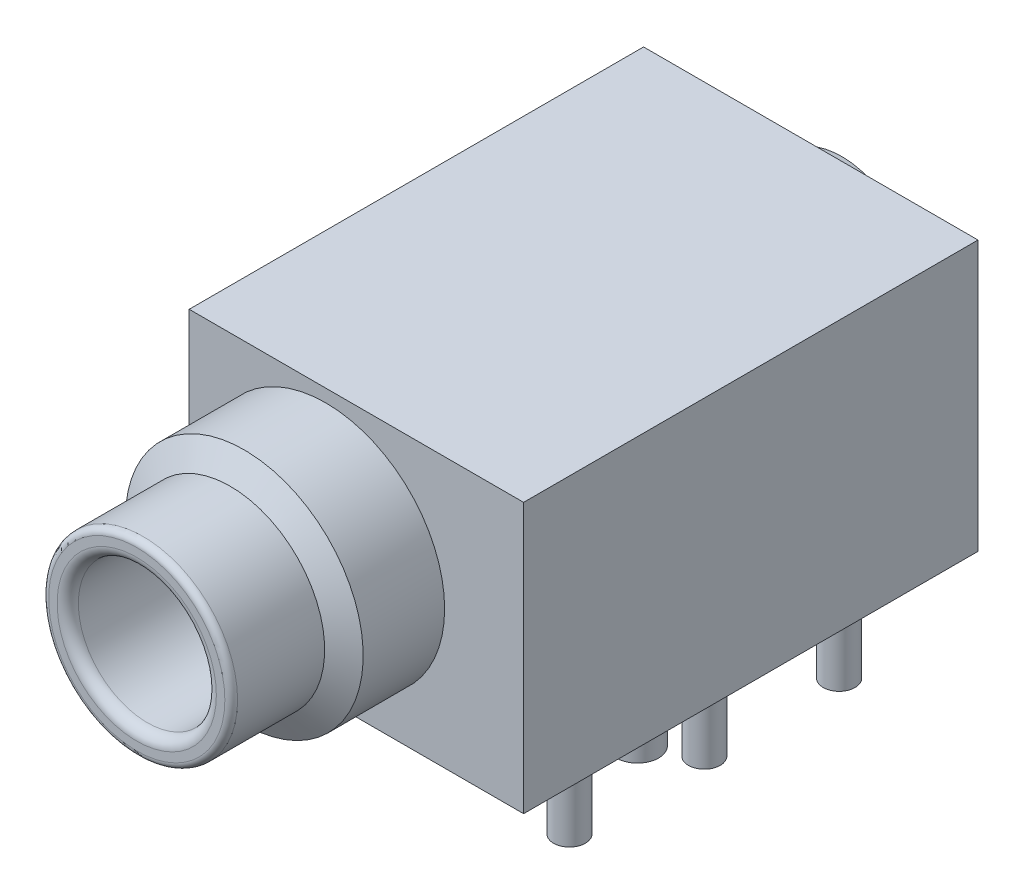
ISO-10303-21;
HEADER;
FILE_DESCRIPTION(('STEP AP214'),'2;1');
FILE_NAME('part.step','',(''),(''),'','','');
FILE_SCHEMA(('AUTOMOTIVE_DESIGN { 1 0 10303 214 1 1 1 1 }'));
ENDSEC;
DATA;
#1=APPLICATION_CONTEXT('core data for automotive mechanical design processes');
#2=APPLICATION_PROTOCOL_DEFINITION('international standard','automotive_design',2000,#1);
#3=PRODUCT_CONTEXT('',#1,'mechanical');
#4=PRODUCT('Part','Part','',(#3));
#5=PRODUCT_RELATED_PRODUCT_CATEGORY('part','',(#4));
#6=PRODUCT_DEFINITION_FORMATION('','',#4);
#7=PRODUCT_DEFINITION_CONTEXT('part definition',#1,'design');
#8=PRODUCT_DEFINITION('design','',#6,#7);
#9=PRODUCT_DEFINITION_SHAPE('','',#8);
#10=(LENGTH_UNIT() NAMED_UNIT(*) SI_UNIT(.MILLI.,.METRE.));
#11=(NAMED_UNIT(*) PLANE_ANGLE_UNIT() SI_UNIT($,.RADIAN.));
#12=(NAMED_UNIT(*) SI_UNIT($,.STERADIAN.) SOLID_ANGLE_UNIT());
#13=UNCERTAINTY_MEASURE_WITH_UNIT(LENGTH_MEASURE(1.E-05),#10,'distance_accuracy_value','');
#14=(GEOMETRIC_REPRESENTATION_CONTEXT(3) GLOBAL_UNCERTAINTY_ASSIGNED_CONTEXT((#13)) GLOBAL_UNIT_ASSIGNED_CONTEXT((#10,
#11,#12)) REPRESENTATION_CONTEXT('',''));
#15=CARTESIAN_POINT('',(0.,0.,0.));
#16=DIRECTION('',(0.,0.,1.));
#17=DIRECTION('',(1.,0.,0.));
#18=AXIS2_PLACEMENT_3D('',#15,#16,#17);
#19=CARTESIAN_POINT('',(-6.43,12.7,-21.4));
#20=DIRECTION('',(0.,0.,-1.));
#21=DIRECTION('',(-1.,0.,0.));
#22=AXIS2_PLACEMENT_3D('',#19,#20,#21);
#23=PLANE('',#22);
#24=CARTESIAN_POINT('',(0.,6.5,-21.4));
#25=DIRECTION('',(0.,0.,-1.));
#26=DIRECTION('',(-1.,0.,0.));
#27=AXIS2_PLACEMENT_3D('',#24,#25,#26);
#28=CIRCLE('',#27,4.15000000002129);
#29=CARTESIAN_POINT('',(-4.15000000002129,6.5,-21.4));
#30=VERTEX_POINT('',#29);
#31=EDGE_CURVE('E152',#30,#30,#28,.T.);
#32=ORIENTED_EDGE('',*,*,#31,.F.);
#33=EDGE_LOOP('',(#32));
#34=FACE_BOUND('',#33,.T.);
#35=DIRECTION('',(1.,0.,0.));
#36=VECTOR('',#35,1.);
#37=CARTESIAN_POINT('',(-6.43,0.,-21.4));
#38=LINE('',#37,#36);
#39=CARTESIAN_POINT('',(-6.43,0.,-21.4));
#40=VERTEX_POINT('',#39);
#41=CARTESIAN_POINT('',(9.32,0.,-21.4));
#42=VERTEX_POINT('',#41);
#43=EDGE_CURVE('E132',#40,#42,#38,.T.);
#44=ORIENTED_EDGE('',*,*,#43,.F.);
#45=DIRECTION('',(0.,-1.,0.));
#46=VECTOR('',#45,1.);
#47=CARTESIAN_POINT('',(-6.43,12.7,-21.4));
#48=LINE('',#47,#46);
#49=CARTESIAN_POINT('',(-6.43,12.7,-21.4));
#50=VERTEX_POINT('',#49);
#51=EDGE_CURVE('E49',#50,#40,#48,.T.);
#52=ORIENTED_EDGE('',*,*,#51,.F.);
#53=DIRECTION('',(1.,0.,0.));
#54=VECTOR('',#53,1.);
#55=CARTESIAN_POINT('',(-6.43,12.7,-21.4));
#56=LINE('',#55,#54);
#57=CARTESIAN_POINT('',(9.32,12.7,-21.4));
#58=VERTEX_POINT('',#57);
#59=EDGE_CURVE('E133',#50,#58,#56,.T.);
#60=ORIENTED_EDGE('',*,*,#59,.T.);
#61=DIRECTION('',(0.,-1.,0.));
#62=VECTOR('',#61,1.);
#63=CARTESIAN_POINT('',(9.32,12.7,-21.4));
#64=LINE('',#63,#62);
#65=EDGE_CURVE('E78',#58,#42,#64,.T.);
#66=ORIENTED_EDGE('',*,*,#65,.T.);
#67=EDGE_LOOP('',(#44,#52,#60,#66));
#68=FACE_BOUND('',#67,.T.);
#69=ADVANCED_FACE('F32',(#34,#68),#23,.T.);
#70=CARTESIAN_POINT('',(-6.43,12.7,0.));
#71=DIRECTION('',(-1.,0.,0.));
#72=DIRECTION('',(0.,0.,1.));
#73=AXIS2_PLACEMENT_3D('',#70,#71,#72);
#74=PLANE('',#73);
#75=DIRECTION('',(0.,0.,-1.));
#76=VECTOR('',#75,1.);
#77=CARTESIAN_POINT('',(-6.43,0.,0.));
#78=LINE('',#77,#76);
#79=CARTESIAN_POINT('',(-6.43,0.,0.));
#80=VERTEX_POINT('',#79);
#81=EDGE_CURVE('E136',#80,#40,#78,.T.);
#82=ORIENTED_EDGE('',*,*,#81,.F.);
#83=DIRECTION('',(0.,-1.,0.));
#84=VECTOR('',#83,1.);
#85=CARTESIAN_POINT('',(-6.43,12.7,0.));
#86=LINE('',#85,#84);
#87=CARTESIAN_POINT('',(-6.43,12.7,0.));
#88=VERTEX_POINT('',#87);
#89=EDGE_CURVE('E67',#88,#80,#86,.T.);
#90=ORIENTED_EDGE('',*,*,#89,.F.);
#91=DIRECTION('',(0.,0.,-1.));
#92=VECTOR('',#91,1.);
#93=CARTESIAN_POINT('',(-6.43,12.7,0.));
#94=LINE('',#93,#92);
#95=EDGE_CURVE('E140',#88,#50,#94,.T.);
#96=ORIENTED_EDGE('',*,*,#95,.T.);
#97=ORIENTED_EDGE('',*,*,#51,.T.);
#98=EDGE_LOOP('',(#82,#90,#96,#97));
#99=FACE_BOUND('',#98,.T.);
#100=ADVANCED_FACE('F207',(#99),#74,.T.);
#101=CARTESIAN_POINT('',(9.32,12.7,0.));
#102=DIRECTION('',(0.,0.,1.));
#103=DIRECTION('',(1.,0.,0.));
#104=AXIS2_PLACEMENT_3D('',#101,#102,#103);
#105=PLANE('',#104);
#106=CARTESIAN_POINT('',(0.,6.5,0.));
#107=DIRECTION('',(0.,0.,1.));
#108=DIRECTION('',(1.,0.,0.));
#109=AXIS2_PLACEMENT_3D('',#106,#107,#108);
#110=CIRCLE('',#109,5.60000000000746);
#111=CARTESIAN_POINT('',(5.60000000000746,6.5,0.));
#112=VERTEX_POINT('',#111);
#113=EDGE_CURVE('E186',#112,#112,#110,.T.);
#114=ORIENTED_EDGE('',*,*,#113,.F.);
#115=EDGE_LOOP('',(#114));
#116=FACE_BOUND('',#115,.T.);
#117=DIRECTION('',(-1.,0.,0.));
#118=VECTOR('',#117,1.);
#119=CARTESIAN_POINT('',(9.32,0.,0.));
#120=LINE('',#119,#118);
#121=CARTESIAN_POINT('',(9.32,0.,0.));
#122=VERTEX_POINT('',#121);
#123=EDGE_CURVE('E147',#122,#80,#120,.T.);
#124=ORIENTED_EDGE('',*,*,#123,.F.);
#125=DIRECTION('',(0.,-1.,0.));
#126=VECTOR('',#125,1.);
#127=CARTESIAN_POINT('',(9.32,12.7,0.));
#128=LINE('',#127,#126);
#129=CARTESIAN_POINT('',(9.32,12.7,0.));
#130=VERTEX_POINT('',#129);
#131=EDGE_CURVE('E154',#130,#122,#128,.T.);
#132=ORIENTED_EDGE('',*,*,#131,.F.);
#133=DIRECTION('',(-1.,0.,0.));
#134=VECTOR('',#133,1.);
#135=CARTESIAN_POINT('',(9.32,12.7,0.));
#136=LINE('',#135,#134);
#137=EDGE_CURVE('E138',#130,#88,#136,.T.);
#138=ORIENTED_EDGE('',*,*,#137,.T.);
#139=ORIENTED_EDGE('',*,*,#89,.T.);
#140=EDGE_LOOP('',(#124,#132,#138,#139));
#141=FACE_BOUND('',#140,.T.);
#142=ADVANCED_FACE('F213',(#116,#141),#105,.T.);
#143=CARTESIAN_POINT('',(9.32,12.7,-21.4));
#144=DIRECTION('',(1.,0.,0.));
#145=DIRECTION('',(0.,0.,-1.));
#146=AXIS2_PLACEMENT_3D('',#143,#144,#145);
#147=PLANE('',#146);
#148=DIRECTION('',(0.,0.,1.));
#149=VECTOR('',#148,1.);
#150=CARTESIAN_POINT('',(9.32,0.,-21.4));
#151=LINE('',#150,#149);
#152=EDGE_CURVE('E144',#42,#122,#151,.T.);
#153=ORIENTED_EDGE('',*,*,#152,.F.);
#154=ORIENTED_EDGE('',*,*,#65,.F.);
#155=DIRECTION('',(0.,0.,1.));
#156=VECTOR('',#155,1.);
#157=CARTESIAN_POINT('',(9.32,12.7,-21.4));
#158=LINE('',#157,#156);
#159=EDGE_CURVE('E135',#58,#130,#158,.T.);
#160=ORIENTED_EDGE('',*,*,#159,.T.);
#161=ORIENTED_EDGE('',*,*,#131,.T.);
#162=EDGE_LOOP('',(#153,#154,#160,#161));
#163=FACE_BOUND('',#162,.T.);
#164=ADVANCED_FACE('F217',(#163),#147,.T.);
#165=CARTESIAN_POINT('',(0.,12.7,0.));
#166=DIRECTION('',(0.,-1.,0.));
#167=DIRECTION('',(0.,0.,-1.));
#168=AXIS2_PLACEMENT_3D('',#165,#166,#167);
#169=PLANE('',#168);
#170=ORIENTED_EDGE('',*,*,#59,.F.);
#171=ORIENTED_EDGE('',*,*,#95,.F.);
#172=ORIENTED_EDGE('',*,*,#137,.F.);
#173=ORIENTED_EDGE('',*,*,#159,.F.);
#174=EDGE_LOOP('',(#170,#171,#172,#173));
#175=FACE_BOUND('',#174,.T.);
#176=ADVANCED_FACE('F220',(#175),#169,.F.);
#177=CARTESIAN_POINT('',(0.,0.,0.));
#178=DIRECTION('',(0.,-1.,0.));
#179=DIRECTION('',(0.,0.,-1.));
#180=AXIS2_PLACEMENT_3D('',#177,#178,#179);
#181=PLANE('',#180);
#182=CARTESIAN_POINT('',(-4.2,0.,-7.45));
#183=DIRECTION('',(0.,-1.,0.));
#184=DIRECTION('',(0.,0.,-1.));
#185=AXIS2_PLACEMENT_3D('',#182,#183,#184);
#186=CIRCLE('',#185,1.);
#187=CARTESIAN_POINT('',(-4.2,0.,-8.45));
#188=VERTEX_POINT('',#187);
#189=EDGE_CURVE('E183',#188,#188,#186,.T.);
#190=ORIENTED_EDGE('',*,*,#189,.F.);
#191=EDGE_LOOP('',(#190));
#192=FACE_BOUND('',#191,.T.);
#193=CARTESIAN_POINT('',(7.23,0.,-7.45));
#194=DIRECTION('',(0.,-1.,0.));
#195=DIRECTION('',(0.,0.,-1.));
#196=AXIS2_PLACEMENT_3D('',#193,#194,#195);
#197=CIRCLE('',#196,1.);
#198=CARTESIAN_POINT('',(7.23,0.,-8.45));
#199=VERTEX_POINT('',#198);
#200=EDGE_CURVE('E180',#199,#199,#197,.T.);
#201=ORIENTED_EDGE('',*,*,#200,.F.);
#202=EDGE_LOOP('',(#201));
#203=FACE_BOUND('',#202,.T.);
#204=CARTESIAN_POINT('',(5.1,0.,-13.8));
#205=DIRECTION('',(0.,-1.,0.));
#206=DIRECTION('',(0.,0.,-1.));
#207=AXIS2_PLACEMENT_3D('',#204,#205,#206);
#208=CIRCLE('',#207,1.5);
#209=CARTESIAN_POINT('',(5.1,0.,-15.3));
#210=VERTEX_POINT('',#209);
#211=EDGE_CURVE('E177',#210,#210,#208,.T.);
#212=ORIENTED_EDGE('',*,*,#211,.F.);
#213=EDGE_LOOP('',(#212));
#214=FACE_BOUND('',#213,.T.);
#215=CARTESIAN_POINT('',(7.23,0.,-4.25));
#216=DIRECTION('',(0.,-1.,0.));
#217=DIRECTION('',(0.,0.,-1.));
#218=AXIS2_PLACEMENT_3D('',#215,#216,#217);
#219=CIRCLE('',#218,0.750000000000001);
#220=CARTESIAN_POINT('',(7.23,0.,-5.));
#221=VERTEX_POINT('',#220);
#222=EDGE_CURVE('E174',#221,#221,#219,.T.);
#223=ORIENTED_EDGE('',*,*,#222,.F.);
#224=EDGE_LOOP('',(#223));
#225=FACE_BOUND('',#224,.T.);
#226=CARTESIAN_POINT('',(7.23,0.,-16.95));
#227=DIRECTION('',(0.,-1.,0.));
#228=DIRECTION('',(0.,0.,-1.));
#229=AXIS2_PLACEMENT_3D('',#226,#227,#228);
#230=CIRCLE('',#229,0.750000000000001);
#231=CARTESIAN_POINT('',(7.23,0.,-17.7));
#232=VERTEX_POINT('',#231);
#233=EDGE_CURVE('E171',#232,#232,#230,.T.);
#234=ORIENTED_EDGE('',*,*,#233,.F.);
#235=EDGE_LOOP('',(#234));
#236=FACE_BOUND('',#235,.T.);
#237=CARTESIAN_POINT('',(-4.2,0.,-4.25));
#238=DIRECTION('',(0.,-1.,0.));
#239=DIRECTION('',(0.,0.,-1.));
#240=AXIS2_PLACEMENT_3D('',#237,#238,#239);
#241=CIRCLE('',#240,0.75);
#242=CARTESIAN_POINT('',(-4.2,0.,-5.));
#243=VERTEX_POINT('',#242);
#244=EDGE_CURVE('E168',#243,#243,#241,.T.);
#245=ORIENTED_EDGE('',*,*,#244,.F.);
#246=EDGE_LOOP('',(#245));
#247=FACE_BOUND('',#246,.T.);
#248=CARTESIAN_POINT('',(-4.2,0.,-16.95));
#249=DIRECTION('',(0.,-1.,0.));
#250=DIRECTION('',(0.,0.,-1.));
#251=AXIS2_PLACEMENT_3D('',#248,#249,#250);
#252=CIRCLE('',#251,0.75);
#253=CARTESIAN_POINT('',(-4.2,0.,-17.7));
#254=VERTEX_POINT('',#253);
#255=EDGE_CURVE('E165',#254,#254,#252,.T.);
#256=ORIENTED_EDGE('',*,*,#255,.F.);
#257=EDGE_LOOP('',(#256));
#258=FACE_BOUND('',#257,.T.);
#259=CARTESIAN_POINT('',(7.23,0.,-10.6));
#260=DIRECTION('',(0.,-1.,0.));
#261=DIRECTION('',(0.,0.,-1.));
#262=AXIS2_PLACEMENT_3D('',#259,#260,#261);
#263=CIRCLE('',#262,0.750000000000001);
#264=CARTESIAN_POINT('',(7.23,0.,-11.35));
#265=VERTEX_POINT('',#264);
#266=EDGE_CURVE('E162',#265,#265,#263,.T.);
#267=ORIENTED_EDGE('',*,*,#266,.F.);
#268=EDGE_LOOP('',(#267));
#269=FACE_BOUND('',#268,.T.);
#270=CARTESIAN_POINT('',(-4.2,0.,-10.6));
#271=DIRECTION('',(0.,-1.,0.));
#272=DIRECTION('',(0.,0.,-1.));
#273=AXIS2_PLACEMENT_3D('',#270,#271,#272);
#274=CIRCLE('',#273,0.75);
#275=CARTESIAN_POINT('',(-4.2,0.,-11.35));
#276=VERTEX_POINT('',#275);
#277=EDGE_CURVE('E159',#276,#276,#274,.T.);
#278=ORIENTED_EDGE('',*,*,#277,.F.);
#279=EDGE_LOOP('',(#278));
#280=FACE_BOUND('',#279,.T.);
#281=ORIENTED_EDGE('',*,*,#43,.T.);
#282=ORIENTED_EDGE('',*,*,#152,.T.);
#283=ORIENTED_EDGE('',*,*,#123,.T.);
#284=ORIENTED_EDGE('',*,*,#81,.T.);
#285=EDGE_LOOP('',(#281,#282,#283,#284));
#286=FACE_BOUND('',#285,.T.);
#287=ADVANCED_FACE('F224',(#192,#203,#214,#225,#236,#247,#258,#269,#280,#286),#181,.T.);
#288=CARTESIAN_POINT('',(0.,6.5,-24.3));
#289=DIRECTION('',(0.,0.,1.));
#290=DIRECTION('',(1.,0.,0.));
#291=AXIS2_PLACEMENT_3D('',#288,#289,#290);
#292=CONICAL_SURFACE('',#291,3.50000000001933,0.220493761367315);
#293=ORIENTED_EDGE('',*,*,#31,.T.);
#294=EDGE_LOOP('',(#293));
#295=FACE_BOUND('',#294,.T.);
#296=CARTESIAN_POINT('',(0.,6.5,-24.3));
#297=DIRECTION('',(0.,0.,-1.));
#298=DIRECTION('',(-1.,0.,0.));
#299=AXIS2_PLACEMENT_3D('',#296,#297,#298);
#300=CIRCLE('',#299,3.50000000001933);
#301=CARTESIAN_POINT('',(-3.50000000001933,6.5,-24.3));
#302=VERTEX_POINT('',#301);
#303=EDGE_CURVE('E129',#302,#302,#300,.T.);
#304=ORIENTED_EDGE('',*,*,#303,.F.);
#305=EDGE_LOOP('',(#304));
#306=FACE_BOUND('',#305,.T.);
#307=ADVANCED_FACE('F227',(#295,#306),#292,.T.);
#308=CARTESIAN_POINT('',(0.,6.5,-24.3));
#309=DIRECTION('',(0.,0.,-1.));
#310=DIRECTION('',(-1.,0.,0.));
#311=AXIS2_PLACEMENT_3D('',#308,#309,#310);
#312=PLANE('',#311);
#313=ORIENTED_EDGE('',*,*,#303,.T.);
#314=EDGE_LOOP('',(#313));
#315=FACE_BOUND('',#314,.T.);
#316=ADVANCED_FACE('F234',(#315),#312,.T.);
#317=CARTESIAN_POINT('',(-4.2,0.,-10.6));
#318=DIRECTION('',(0.,-1.,0.));
#319=DIRECTION('',(0.,0.,-1.));
#320=AXIS2_PLACEMENT_3D('',#317,#318,#319);
#321=CYLINDRICAL_SURFACE('',#320,0.75);
#322=ORIENTED_EDGE('',*,*,#277,.T.);
#323=EDGE_LOOP('',(#322));
#324=FACE_BOUND('',#323,.T.);
#325=CARTESIAN_POINT('',(-4.2,-4.,-10.6));
#326=DIRECTION('',(0.,-1.,0.));
#327=DIRECTION('',(0.,0.,-1.));
#328=AXIS2_PLACEMENT_3D('',#325,#326,#327);
#329=CIRCLE('',#328,0.75);
#330=CARTESIAN_POINT('',(-4.2,-4.,-11.35));
#331=VERTEX_POINT('',#330);
#332=EDGE_CURVE('E126',#331,#331,#329,.T.);
#333=ORIENTED_EDGE('',*,*,#332,.F.);
#334=EDGE_LOOP('',(#333));
#335=FACE_BOUND('',#334,.T.);
#336=ADVANCED_FACE('F238',(#324,#335),#321,.T.);
#337=CARTESIAN_POINT('',(-4.2,-4.,-10.6));
#338=DIRECTION('',(0.,-1.,0.));
#339=DIRECTION('',(0.,0.,-1.));
#340=AXIS2_PLACEMENT_3D('',#337,#338,#339);
#341=PLANE('',#340);
#342=ORIENTED_EDGE('',*,*,#332,.T.);
#343=EDGE_LOOP('',(#342));
#344=FACE_BOUND('',#343,.T.);
#345=ADVANCED_FACE('F242',(#344),#341,.T.);
#346=CARTESIAN_POINT('',(7.23,0.,-10.6));
#347=DIRECTION('',(0.,-1.,0.));
#348=DIRECTION('',(0.,0.,-1.));
#349=AXIS2_PLACEMENT_3D('',#346,#347,#348);
#350=CYLINDRICAL_SURFACE('',#349,0.750000000000001);
#351=ORIENTED_EDGE('',*,*,#266,.T.);
#352=EDGE_LOOP('',(#351));
#353=FACE_BOUND('',#352,.T.);
#354=CARTESIAN_POINT('',(7.23,-4.,-10.6));
#355=DIRECTION('',(0.,-1.,0.));
#356=DIRECTION('',(0.,0.,-1.));
#357=AXIS2_PLACEMENT_3D('',#354,#355,#356);
#358=CIRCLE('',#357,0.750000000000001);
#359=CARTESIAN_POINT('',(7.23,-4.,-11.35));
#360=VERTEX_POINT('',#359);
#361=EDGE_CURVE('E123',#360,#360,#358,.T.);
#362=ORIENTED_EDGE('',*,*,#361,.F.);
#363=EDGE_LOOP('',(#362));
#364=FACE_BOUND('',#363,.T.);
#365=ADVANCED_FACE('F246',(#353,#364),#350,.T.);
#366=CARTESIAN_POINT('',(7.23,-4.,-10.6));
#367=DIRECTION('',(0.,-1.,0.));
#368=DIRECTION('',(0.,0.,-1.));
#369=AXIS2_PLACEMENT_3D('',#366,#367,#368);
#370=PLANE('',#369);
#371=ORIENTED_EDGE('',*,*,#361,.T.);
#372=EDGE_LOOP('',(#371));
#373=FACE_BOUND('',#372,.T.);
#374=ADVANCED_FACE('F250',(#373),#370,.T.);
#375=CARTESIAN_POINT('',(-4.2,0.,-16.95));
#376=DIRECTION('',(0.,-1.,0.));
#377=DIRECTION('',(0.,0.,-1.));
#378=AXIS2_PLACEMENT_3D('',#375,#376,#377);
#379=CYLINDRICAL_SURFACE('',#378,0.75);
#380=ORIENTED_EDGE('',*,*,#255,.T.);
#381=EDGE_LOOP('',(#380));
#382=FACE_BOUND('',#381,.T.);
#383=CARTESIAN_POINT('',(-4.2,-4.,-16.95));
#384=DIRECTION('',(0.,-1.,0.));
#385=DIRECTION('',(0.,0.,-1.));
#386=AXIS2_PLACEMENT_3D('',#383,#384,#385);
#387=CIRCLE('',#386,0.75);
#388=CARTESIAN_POINT('',(-4.2,-4.,-17.7));
#389=VERTEX_POINT('',#388);
#390=EDGE_CURVE('E120',#389,#389,#387,.T.);
#391=ORIENTED_EDGE('',*,*,#390,.F.);
#392=EDGE_LOOP('',(#391));
#393=FACE_BOUND('',#392,.T.);
#394=ADVANCED_FACE('F254',(#382,#393),#379,.T.);
#395=CARTESIAN_POINT('',(-4.2,-4.,-16.95));
#396=DIRECTION('',(0.,-1.,0.));
#397=DIRECTION('',(0.,0.,-1.));
#398=AXIS2_PLACEMENT_3D('',#395,#396,#397);
#399=PLANE('',#398);
#400=ORIENTED_EDGE('',*,*,#390,.T.);
#401=EDGE_LOOP('',(#400));
#402=FACE_BOUND('',#401,.T.);
#403=ADVANCED_FACE('F258',(#402),#399,.T.);
#404=CARTESIAN_POINT('',(-4.2,0.,-4.25));
#405=DIRECTION('',(0.,-1.,0.));
#406=DIRECTION('',(0.,0.,-1.));
#407=AXIS2_PLACEMENT_3D('',#404,#405,#406);
#408=CYLINDRICAL_SURFACE('',#407,0.75);
#409=ORIENTED_EDGE('',*,*,#244,.T.);
#410=EDGE_LOOP('',(#409));
#411=FACE_BOUND('',#410,.T.);
#412=CARTESIAN_POINT('',(-4.2,-4.,-4.25));
#413=DIRECTION('',(0.,-1.,0.));
#414=DIRECTION('',(0.,0.,-1.));
#415=AXIS2_PLACEMENT_3D('',#412,#413,#414);
#416=CIRCLE('',#415,0.75);
#417=CARTESIAN_POINT('',(-4.2,-4.,-5.));
#418=VERTEX_POINT('',#417);
#419=EDGE_CURVE('E117',#418,#418,#416,.T.);
#420=ORIENTED_EDGE('',*,*,#419,.F.);
#421=EDGE_LOOP('',(#420));
#422=FACE_BOUND('',#421,.T.);
#423=ADVANCED_FACE('F262',(#411,#422),#408,.T.);
#424=CARTESIAN_POINT('',(-4.2,-4.,-4.25));
#425=DIRECTION('',(0.,-1.,0.));
#426=DIRECTION('',(0.,0.,-1.));
#427=AXIS2_PLACEMENT_3D('',#424,#425,#426);
#428=PLANE('',#427);
#429=ORIENTED_EDGE('',*,*,#419,.T.);
#430=EDGE_LOOP('',(#429));
#431=FACE_BOUND('',#430,.T.);
#432=ADVANCED_FACE('F266',(#431),#428,.T.);
#433=CARTESIAN_POINT('',(7.23,0.,-16.95));
#434=DIRECTION('',(0.,-1.,0.));
#435=DIRECTION('',(0.,0.,-1.));
#436=AXIS2_PLACEMENT_3D('',#433,#434,#435);
#437=CYLINDRICAL_SURFACE('',#436,0.750000000000001);
#438=ORIENTED_EDGE('',*,*,#233,.T.);
#439=EDGE_LOOP('',(#438));
#440=FACE_BOUND('',#439,.T.);
#441=CARTESIAN_POINT('',(7.23,-4.,-16.95));
#442=DIRECTION('',(0.,-1.,0.));
#443=DIRECTION('',(0.,0.,-1.));
#444=AXIS2_PLACEMENT_3D('',#441,#442,#443);
#445=CIRCLE('',#444,0.750000000000001);
#446=CARTESIAN_POINT('',(7.23,-4.,-17.7));
#447=VERTEX_POINT('',#446);
#448=EDGE_CURVE('E114',#447,#447,#445,.T.);
#449=ORIENTED_EDGE('',*,*,#448,.F.);
#450=EDGE_LOOP('',(#449));
#451=FACE_BOUND('',#450,.T.);
#452=ADVANCED_FACE('F270',(#440,#451),#437,.T.);
#453=CARTESIAN_POINT('',(7.23,-4.,-16.95));
#454=DIRECTION('',(0.,-1.,0.));
#455=DIRECTION('',(0.,0.,-1.));
#456=AXIS2_PLACEMENT_3D('',#453,#454,#455);
#457=PLANE('',#456);
#458=ORIENTED_EDGE('',*,*,#448,.T.);
#459=EDGE_LOOP('',(#458));
#460=FACE_BOUND('',#459,.T.);
#461=ADVANCED_FACE('F274',(#460),#457,.T.);
#462=CARTESIAN_POINT('',(7.23,0.,-4.25));
#463=DIRECTION('',(0.,-1.,0.));
#464=DIRECTION('',(0.,0.,-1.));
#465=AXIS2_PLACEMENT_3D('',#462,#463,#464);
#466=CYLINDRICAL_SURFACE('',#465,0.750000000000001);
#467=ORIENTED_EDGE('',*,*,#222,.T.);
#468=EDGE_LOOP('',(#467));
#469=FACE_BOUND('',#468,.T.);
#470=CARTESIAN_POINT('',(7.23,-4.,-4.25));
#471=DIRECTION('',(0.,-1.,0.));
#472=DIRECTION('',(0.,0.,-1.));
#473=AXIS2_PLACEMENT_3D('',#470,#471,#472);
#474=CIRCLE('',#473,0.750000000000001);
#475=CARTESIAN_POINT('',(7.23,-4.,-5.));
#476=VERTEX_POINT('',#475);
#477=EDGE_CURVE('E111',#476,#476,#474,.T.);
#478=ORIENTED_EDGE('',*,*,#477,.F.);
#479=EDGE_LOOP('',(#478));
#480=FACE_BOUND('',#479,.T.);
#481=ADVANCED_FACE('F278',(#469,#480),#466,.T.);
#482=CARTESIAN_POINT('',(7.23,-4.,-4.25));
#483=DIRECTION('',(0.,-1.,0.));
#484=DIRECTION('',(0.,0.,-1.));
#485=AXIS2_PLACEMENT_3D('',#482,#483,#484);
#486=PLANE('',#485);
#487=ORIENTED_EDGE('',*,*,#477,.T.);
#488=EDGE_LOOP('',(#487));
#489=FACE_BOUND('',#488,.T.);
#490=ADVANCED_FACE('F282',(#489),#486,.T.);
#491=CARTESIAN_POINT('',(5.1,0.,-13.8));
#492=DIRECTION('',(0.,-1.,0.));
#493=DIRECTION('',(1.,0.,0.));
#494=AXIS2_PLACEMENT_3D('',#491,#492,#493);
#495=CYLINDRICAL_SURFACE('',#494,1.5);
#496=ORIENTED_EDGE('',*,*,#211,.T.);
#497=EDGE_LOOP('',(#496));
#498=FACE_BOUND('',#497,.T.);
#499=CARTESIAN_POINT('',(5.1,-2.,-13.8));
#500=DIRECTION('',(0.,-1.,0.));
#501=DIRECTION('',(1.,0.,0.));
#502=AXIS2_PLACEMENT_3D('',#499,#500,#501);
#503=CIRCLE('',#502,1.5);
#504=CARTESIAN_POINT('',(6.6,-2.,-13.8));
#505=VERTEX_POINT('',#504);
#506=EDGE_CURVE('E108',#505,#505,#503,.T.);
#507=ORIENTED_EDGE('',*,*,#506,.F.);
#508=EDGE_LOOP('',(#507));
#509=FACE_BOUND('',#508,.T.);
#510=ADVANCED_FACE('F286',(#498,#509),#495,.T.);
#511=CARTESIAN_POINT('',(5.1,-2.,-13.8));
#512=DIRECTION('',(0.,-1.,0.));
#513=DIRECTION('',(1.,0.,0.));
#514=AXIS2_PLACEMENT_3D('',#511,#512,#513);
#515=PLANE('',#514);
#516=ORIENTED_EDGE('',*,*,#506,.T.);
#517=EDGE_LOOP('',(#516));
#518=FACE_BOUND('',#517,.T.);
#519=ADVANCED_FACE('F290',(#518),#515,.T.);
#520=CARTESIAN_POINT('',(7.23,0.,-7.45));
#521=DIRECTION('',(0.,-1.,0.));
#522=DIRECTION('',(0.,0.,-1.));
#523=AXIS2_PLACEMENT_3D('',#520,#521,#522);
#524=CYLINDRICAL_SURFACE('',#523,1.);
#525=ORIENTED_EDGE('',*,*,#200,.T.);
#526=EDGE_LOOP('',(#525));
#527=FACE_BOUND('',#526,.T.);
#528=CARTESIAN_POINT('',(7.23,-2.,-7.45));
#529=DIRECTION('',(0.,-1.,0.));
#530=DIRECTION('',(0.,0.,-1.));
#531=AXIS2_PLACEMENT_3D('',#528,#529,#530);
#532=CIRCLE('',#531,1.);
#533=CARTESIAN_POINT('',(7.23,-2.,-8.45));
#534=VERTEX_POINT('',#533);
#535=EDGE_CURVE('E105',#534,#534,#532,.T.);
#536=ORIENTED_EDGE('',*,*,#535,.F.);
#537=EDGE_LOOP('',(#536));
#538=FACE_BOUND('',#537,.T.);
#539=ADVANCED_FACE('F294',(#527,#538),#524,.T.);
#540=CARTESIAN_POINT('',(7.23,-2.,-7.45));
#541=DIRECTION('',(0.,-1.,0.));
#542=DIRECTION('',(0.,0.,-1.));
#543=AXIS2_PLACEMENT_3D('',#540,#541,#542);
#544=PLANE('',#543);
#545=ORIENTED_EDGE('',*,*,#535,.T.);
#546=EDGE_LOOP('',(#545));
#547=FACE_BOUND('',#546,.T.);
#548=ADVANCED_FACE('F298',(#547),#544,.T.);
#549=CARTESIAN_POINT('',(-4.2,0.,-7.45));
#550=DIRECTION('',(0.,-1.,0.));
#551=DIRECTION('',(0.,0.,-1.));
#552=AXIS2_PLACEMENT_3D('',#549,#550,#551);
#553=CYLINDRICAL_SURFACE('',#552,1.);
#554=ORIENTED_EDGE('',*,*,#189,.T.);
#555=EDGE_LOOP('',(#554));
#556=FACE_BOUND('',#555,.T.);
#557=CARTESIAN_POINT('',(-4.2,-2.,-7.45));
#558=DIRECTION('',(0.,-1.,0.));
#559=DIRECTION('',(0.,0.,-1.));
#560=AXIS2_PLACEMENT_3D('',#557,#558,#559);
#561=CIRCLE('',#560,1.);
#562=CARTESIAN_POINT('',(-4.2,-2.,-8.45));
#563=VERTEX_POINT('',#562);
#564=EDGE_CURVE('E102',#563,#563,#561,.T.);
#565=ORIENTED_EDGE('',*,*,#564,.F.);
#566=EDGE_LOOP('',(#565));
#567=FACE_BOUND('',#566,.T.);
#568=ADVANCED_FACE('F302',(#556,#567),#553,.T.);
#569=CARTESIAN_POINT('',(-4.2,-2.,-7.45));
#570=DIRECTION('',(0.,-1.,0.));
#571=DIRECTION('',(0.,0.,-1.));
#572=AXIS2_PLACEMENT_3D('',#569,#570,#571);
#573=PLANE('',#572);
#574=ORIENTED_EDGE('',*,*,#564,.T.);
#575=EDGE_LOOP('',(#574));
#576=FACE_BOUND('',#575,.T.);
#577=ADVANCED_FACE('F306',(#576),#573,.T.);
#578=CARTESIAN_POINT('',(0.,6.5,8.9));
#579=DIRECTION('',(0.,0.,-1.));
#580=DIRECTION('',(-1.,0.,0.));
#581=AXIS2_PLACEMENT_3D('',#578,#579,#580);
#582=CYLINDRICAL_SURFACE('',#581,4.45);
#583=CARTESIAN_POINT('',(0.,6.5,8.6));
#584=DIRECTION('',(0.,0.,1.));
#585=DIRECTION('',(1.,0.,0.));
#586=AXIS2_PLACEMENT_3D('',#583,#584,#585);
#587=CIRCLE('',#586,4.45);
#588=CARTESIAN_POINT('',(4.45,6.5,8.6));
#589=VERTEX_POINT('',#588);
#590=EDGE_CURVE('E189',#589,#589,#587,.F.);
#591=ORIENTED_EDGE('',*,*,#590,.T.);
#592=EDGE_LOOP('',(#591));
#593=FACE_BOUND('',#592,.T.);
#594=CARTESIAN_POINT('',(0.,6.5,4.49999999995043));
#595=DIRECTION('',(0.,0.,-1.));
#596=DIRECTION('',(-1.,0.,0.));
#597=AXIS2_PLACEMENT_3D('',#594,#595,#596);
#598=CIRCLE('',#597,4.45);
#599=CARTESIAN_POINT('',(-4.45,6.5,4.49999999995043));
#600=VERTEX_POINT('',#599);
#601=EDGE_CURVE('E94',#600,#600,#598,.T.);
#602=ORIENTED_EDGE('',*,*,#601,.F.);
#603=EDGE_LOOP('',(#602));
#604=FACE_BOUND('',#603,.T.);
#605=ADVANCED_FACE('F310',(#593,#604),#582,.T.);
#606=CARTESIAN_POINT('',(4.45,6.5,8.9));
#607=DIRECTION('',(0.,0.,1.));
#608=DIRECTION('',(1.,0.,0.));
#609=AXIS2_PLACEMENT_3D('',#606,#607,#608);
#610=PLANE('',#609);
#611=CARTESIAN_POINT('',(0.,6.5,8.9));
#612=DIRECTION('',(0.,0.,1.));
#613=DIRECTION('',(1.,0.,0.));
#614=AXIS2_PLACEMENT_3D('',#611,#612,#613);
#615=CIRCLE('',#614,3.74999999999999);
#616=CARTESIAN_POINT('',(3.74999999999999,6.5,8.9));
#617=VERTEX_POINT('',#616);
#618=EDGE_CURVE('E11',#617,#617,#615,.F.);
#619=ORIENTED_EDGE('',*,*,#618,.T.);
#620=EDGE_LOOP('',(#619));
#621=FACE_BOUND('',#620,.T.);
#622=CARTESIAN_POINT('',(0.,6.5,8.9));
#623=DIRECTION('',(0.,0.,1.));
#624=DIRECTION('',(1.,0.,0.));
#625=AXIS2_PLACEMENT_3D('',#622,#623,#624);
#626=CIRCLE('',#625,4.15);
#627=CARTESIAN_POINT('',(4.15,6.5,8.9));
#628=VERTEX_POINT('',#627);
#629=EDGE_CURVE('E192',#628,#628,#626,.T.);
#630=ORIENTED_EDGE('',*,*,#629,.T.);
#631=EDGE_LOOP('',(#630));
#632=FACE_BOUND('',#631,.T.);
#633=ADVANCED_FACE('F314',(#621,#632),#610,.T.);
#634=CARTESIAN_POINT('',(0.,6.5,8.9));
#635=DIRECTION('',(0.,0.,-1.));
#636=DIRECTION('',(-1.,0.,0.));
#637=AXIS2_PLACEMENT_3D('',#634,#635,#636);
#638=CYLINDRICAL_SURFACE('',#637,5.60000000000746);
#639=CARTESIAN_POINT('',(0.,6.5,3.83604719037805));
#640=DIRECTION('',(0.,0.,-1.));
#641=DIRECTION('',(-1.,0.,0.));
#642=AXIS2_PLACEMENT_3D('',#639,#640,#641);
#643=CIRCLE('',#642,5.60000000000746);
#644=CARTESIAN_POINT('',(-5.60000000000746,6.5,3.83604719037805));
#645=VERTEX_POINT('',#644);
#646=EDGE_CURVE('E97',#645,#645,#643,.T.);
#647=ORIENTED_EDGE('',*,*,#646,.T.);
#648=EDGE_LOOP('',(#647));
#649=FACE_BOUND('',#648,.T.);
#650=ORIENTED_EDGE('',*,*,#113,.T.);
#651=EDGE_LOOP('',(#650));
#652=FACE_BOUND('',#651,.T.);
#653=ADVANCED_FACE('F318',(#649,#652),#638,.T.);
#654=CARTESIAN_POINT('',(0.,6.5,3.83604719037805));
#655=DIRECTION('',(0.,0.,-1.));
#656=DIRECTION('',(-1.,0.,0.));
#657=AXIS2_PLACEMENT_3D('',#654,#655,#656);
#658=CONICAL_SURFACE('',#657,5.60000000000746,1.0471975511966);
#659=ORIENTED_EDGE('',*,*,#601,.T.);
#660=EDGE_LOOP('',(#659));
#661=FACE_BOUND('',#660,.T.);
#662=ORIENTED_EDGE('',*,*,#646,.F.);
#663=EDGE_LOOP('',(#662));
#664=FACE_BOUND('',#663,.T.);
#665=ADVANCED_FACE('F88',(#661,#664),#658,.T.);
#666=CARTESIAN_POINT('',(0.,6.5,-21.22361162513));
#667=DIRECTION('',(0.,0.,1.));
#668=DIRECTION('',(1.,0.,0.));
#669=AXIS2_PLACEMENT_3D('',#666,#667,#668);
#670=CONICAL_SURFACE('',#669,3.24999999999999,1.04719755119691);
#671=CARTESIAN_POINT('',(0.,6.5,-23.0999999999949));
#672=VERTEX_POINT('',#671);
#673=VERTEX_LOOP('',#672);
#674=FACE_BOUND('',#673,.T.);
#675=CARTESIAN_POINT('',(0.,6.5,-21.22361162513));
#676=DIRECTION('',(0.,0.,1.));
#677=DIRECTION('',(1.,0.,0.));
#678=AXIS2_PLACEMENT_3D('',#675,#676,#677);
#679=CIRCLE('',#678,3.24999999999999);
#680=CARTESIAN_POINT('',(3.24999999999999,6.5,-21.22361162513));
#681=VERTEX_POINT('',#680);
#682=EDGE_CURVE('E92',#681,#681,#679,.T.);
#683=ORIENTED_EDGE('',*,*,#682,.T.);
#684=EDGE_LOOP('',(#683));
#685=FACE_BOUND('',#684,.T.);
#686=ADVANCED_FACE('F84',(#674,#685),#670,.F.);
#687=CARTESIAN_POINT('',(0.,6.5,8.9));
#688=DIRECTION('',(0.,0.,1.));
#689=DIRECTION('',(1.,0.,0.));
#690=AXIS2_PLACEMENT_3D('',#687,#688,#689);
#691=CYLINDRICAL_SURFACE('',#690,3.24999999999999);
#692=CARTESIAN_POINT('',(0.,6.5,8.4));
#693=DIRECTION('',(0.,0.,1.));
#694=DIRECTION('',(1.,0.,0.));
#695=AXIS2_PLACEMENT_3D('',#692,#693,#694);
#696=CIRCLE('',#695,3.24999999999999);
#697=CARTESIAN_POINT('',(3.24999999999999,6.5,8.4));
#698=VERTEX_POINT('',#697);
#699=EDGE_CURVE('E41',#698,#698,#696,.T.);
#700=ORIENTED_EDGE('',*,*,#699,.T.);
#701=EDGE_LOOP('',(#700));
#702=FACE_BOUND('',#701,.T.);
#703=ORIENTED_EDGE('',*,*,#682,.F.);
#704=EDGE_LOOP('',(#703));
#705=FACE_BOUND('',#704,.T.);
#706=ADVANCED_FACE('F87',(#702,#705),#691,.F.);
#707=CARTESIAN_POINT('',(0.,6.5,8.6));
#708=DIRECTION('',(0.,0.,1.));
#709=DIRECTION('',(1.,0.,0.));
#710=AXIS2_PLACEMENT_3D('',#707,#708,#709);
#711=TOROIDAL_SURFACE('',#710,4.15,0.3);
#712=ORIENTED_EDGE('',*,*,#629,.F.);
#713=EDGE_LOOP('',(#712));
#714=FACE_BOUND('',#713,.T.);
#715=ORIENTED_EDGE('',*,*,#590,.F.);
#716=EDGE_LOOP('',(#715));
#717=FACE_BOUND('',#716,.T.);
#718=ADVANCED_FACE('F199',(#714,#717),#711,.T.);
#719=CARTESIAN_POINT('',(0.,6.5,8.4));
#720=DIRECTION('',(0.,0.,1.));
#721=DIRECTION('',(1.,0.,0.));
#722=AXIS2_PLACEMENT_3D('',#719,#720,#721);
#723=TOROIDAL_SURFACE('',#722,3.74999999999999,0.5);
#724=ORIENTED_EDGE('',*,*,#618,.F.);
#725=EDGE_LOOP('',(#724));
#726=FACE_BOUND('',#725,.T.);
#727=ORIENTED_EDGE('',*,*,#699,.F.);
#728=EDGE_LOOP('',(#727));
#729=FACE_BOUND('',#728,.T.);
#730=ADVANCED_FACE('F34',(#726,#729),#723,.T.);
#731=CLOSED_SHELL('',(#69,#100,#142,#164,#176,#287,#307,#316,#336,#345,#365,#374,#394,#403,#423,
#432,#452,#461,#481,#490,#510,#519,#539,#548,#568,#577,#605,#633,#653,#665,#686,#706,#718,#730));
#732=MANIFOLD_SOLID_BREP('B2',#731);
#733=ADVANCED_BREP_SHAPE_REPRESENTATION('',(#18,#732),#14);
#734=SHAPE_DEFINITION_REPRESENTATION(#9,#733);
ENDSEC;
END-ISO-10303-21;
